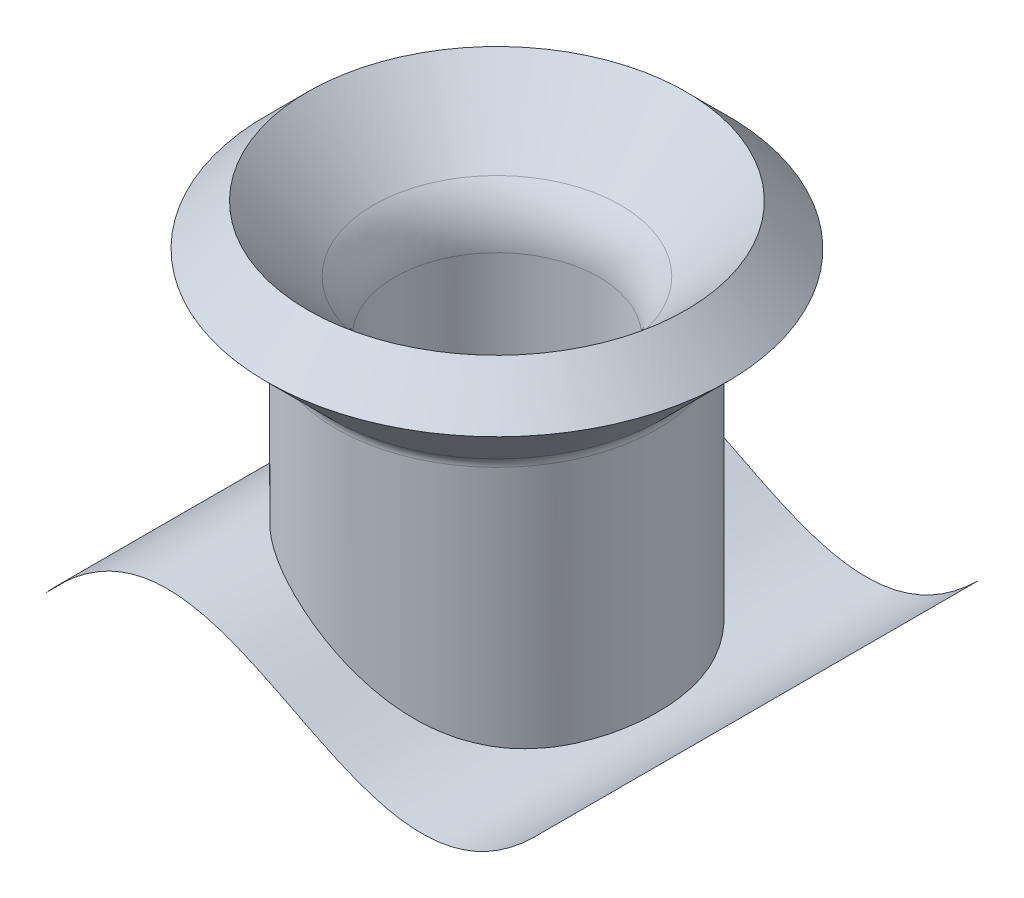
ISO-10303-21;
HEADER;
FILE_DESCRIPTION(('STEP AP214'),'2;1');
FILE_NAME('part.step','',(''),(''),'','','');
FILE_SCHEMA(('AUTOMOTIVE_DESIGN { 1 0 10303 214 1 1 1 1 }'));
ENDSEC;
DATA;
#1=APPLICATION_CONTEXT('core data for automotive mechanical design processes');
#2=APPLICATION_PROTOCOL_DEFINITION('international standard','automotive_design',2000,#1);
#3=PRODUCT_CONTEXT('',#1,'mechanical');
#4=PRODUCT('Part','Part','',(#3));
#5=PRODUCT_RELATED_PRODUCT_CATEGORY('part','',(#4));
#6=PRODUCT_DEFINITION_FORMATION('','',#4);
#7=PRODUCT_DEFINITION_CONTEXT('part definition',#1,'design');
#8=PRODUCT_DEFINITION('design','',#6,#7);
#9=PRODUCT_DEFINITION_SHAPE('','',#8);
#10=(LENGTH_UNIT() NAMED_UNIT(*) SI_UNIT(.MILLI.,.METRE.));
#11=(NAMED_UNIT(*) PLANE_ANGLE_UNIT() SI_UNIT($,.RADIAN.));
#12=(NAMED_UNIT(*) SI_UNIT($,.STERADIAN.) SOLID_ANGLE_UNIT());
#13=UNCERTAINTY_MEASURE_WITH_UNIT(LENGTH_MEASURE(1.E-05),#10,'distance_accuracy_value','');
#14=(GEOMETRIC_REPRESENTATION_CONTEXT(3) GLOBAL_UNCERTAINTY_ASSIGNED_CONTEXT((#13)) GLOBAL_UNIT_ASSIGNED_CONTEXT((#10,
#11,#12)) REPRESENTATION_CONTEXT('',''));
#15=CARTESIAN_POINT('',(0.,0.,0.));
#16=DIRECTION('',(0.,0.,1.));
#17=DIRECTION('',(1.,0.,0.));
#18=AXIS2_PLACEMENT_3D('',#15,#16,#17);
#19=CARTESIAN_POINT('',(44.9906658125201,27.2163737069206,0.));
#20=CARTESIAN_POINT('',(13.6993494881667,-3.55061906770293,0.));
#21=CARTESIAN_POINT('',(-8.62408056963471,56.2244401956315,0.));
#22=CARTESIAN_POINT('',(-39.7507653745492,21.6680669395259,0.));
#23=B_SPLINE_CURVE_WITH_KNOTS('',3,(#19,#20,#21,#22),.UNSPECIFIED.,.F.,.F.,(4,4),(0.,1.),.UNSPECIFIED.);
#24=DIRECTION('',(0.,0.,1.));
#25=VECTOR('',#24,1.);
#26=SURFACE_OF_LINEAR_EXTRUSION('',#23,#25);
#27=CARTESIAN_POINT('',(44.9906658125201,27.2163737069206,38.608));
#28=CARTESIAN_POINT('',(13.6993494881667,-3.55061906770293,38.608));
#29=CARTESIAN_POINT('',(-8.62408056963471,56.2244401956315,38.608));
#30=CARTESIAN_POINT('',(-39.7507653745492,21.6680669395259,38.608));
#31=B_SPLINE_CURVE_WITH_KNOTS('',3,(#27,#28,#29,#30),.UNSPECIFIED.,.F.,.F.,(4,4),(0.,1.),.UNSPECIFIED.);
#32=CARTESIAN_POINT('',(44.9906658125201,27.2163737069206,38.608));
#33=VERTEX_POINT('',#32);
#34=CARTESIAN_POINT('',(-39.7507653745492,21.6680669395259,38.608));
#35=VERTEX_POINT('',#34);
#36=EDGE_CURVE('E61',#33,#35,#31,.T.);
#37=ORIENTED_EDGE('',*,*,#36,.F.);
#38=DIRECTION('',(0.,0.,1.));
#39=VECTOR('',#38,1.);
#40=CARTESIAN_POINT('',(44.9906658125201,27.2163737069206,0.));
#41=LINE('',#40,#39);
#42=CARTESIAN_POINT('',(44.9906658125201,27.2163737069206,-38.608));
#43=VERTEX_POINT('',#42);
#44=EDGE_CURVE('E53',#43,#33,#41,.T.);
#45=ORIENTED_EDGE('',*,*,#44,.F.);
#46=CARTESIAN_POINT('',(44.9906658125201,27.2163737069206,-38.608));
#47=CARTESIAN_POINT('',(13.6993494881667,-3.55061906770293,-38.608));
#48=CARTESIAN_POINT('',(-8.62408056963471,56.2244401956315,-38.608));
#49=CARTESIAN_POINT('',(-39.7507653745492,21.6680669395259,-38.608));
#50=B_SPLINE_CURVE_WITH_KNOTS('',3,(#46,#47,#48,#49),.UNSPECIFIED.,.F.,.F.,(4,4),(0.,1.),.UNSPECIFIED.);
#51=CARTESIAN_POINT('',(-39.7507653745492,21.6680669395259,-38.608));
#52=VERTEX_POINT('',#51);
#53=EDGE_CURVE('E71',#43,#52,#50,.T.);
#54=ORIENTED_EDGE('',*,*,#53,.T.);
#55=DIRECTION('',(0.,0.,1.));
#56=VECTOR('',#55,1.);
#57=CARTESIAN_POINT('',(-39.7507653745492,21.6680669395259,0.));
#58=LINE('',#57,#56);
#59=EDGE_CURVE('E12',#52,#35,#58,.T.);
#60=ORIENTED_EDGE('',*,*,#59,.T.);
#61=EDGE_LOOP('',(#37,#45,#54,#60));
#62=FACE_BOUND('',#61,.T.);
#63=ADVANCED_FACE('F51',(#62),#26,.T.);
#64=OPEN_SHELL('',(#63));
#65=SHELL_BASED_SURFACE_MODEL('B2',(#64));
#66=CARTESIAN_POINT('',(0.,77.6126499684862,0.));
#67=DIRECTION('',(0.,-1.,0.));
#68=DIRECTION('',(0.,0.,-1.));
#69=AXIS2_PLACEMENT_3D('',#66,#67,#68);
#70=CONICAL_SURFACE('',#69,36.4535937540082,0.78539816339745);
#71=CARTESIAN_POINT('',(0.,81.2047524169139,0.));
#72=DIRECTION('',(0.,1.,0.));
#73=DIRECTION('',(0.,0.,1.));
#74=AXIS2_PLACEMENT_3D('',#71,#72,#73);
#75=CIRCLE('',#74,32.8614913055806);
#76=CARTESIAN_POINT('',(0.,81.2047524169139,32.8614913055806));
#77=VERTEX_POINT('',#76);
#78=EDGE_CURVE('E135',#77,#77,#75,.T.);
#79=ORIENTED_EDGE('',*,*,#78,.F.);
#80=EDGE_LOOP('',(#79));
#81=FACE_BOUND('',#80,.T.);
#82=CARTESIAN_POINT('',(0.,74.0205475200586,0.));
#83=DIRECTION('',(0.,1.,0.));
#84=DIRECTION('',(0.,0.,1.));
#85=AXIS2_PLACEMENT_3D('',#82,#83,#84);
#86=CIRCLE('',#85,40.0456962024359);
#87=CARTESIAN_POINT('',(0.,74.0205475200586,40.0456962024359));
#88=VERTEX_POINT('',#87);
#89=EDGE_CURVE('E155',#88,#88,#86,.T.);
#90=ORIENTED_EDGE('',*,*,#89,.T.);
#91=EDGE_LOOP('',(#90));
#92=FACE_BOUND('',#91,.T.);
#93=ADVANCED_FACE('F112',(#81,#92),#70,.T.);
#94=CARTESIAN_POINT('',(0.,67.6001024484277,0.));
#95=DIRECTION('',(0.,1.,0.));
#96=DIRECTION('',(0.,0.,1.));
#97=AXIS2_PLACEMENT_3D('',#94,#95,#96);
#98=CONICAL_SURFACE('',#97,19.2568413370944,0.785398163397447);
#99=ORIENTED_EDGE('',*,*,#78,.T.);
#100=EDGE_LOOP('',(#99));
#101=FACE_BOUND('',#100,.T.);
#102=CARTESIAN_POINT('',(0.,69.8319487757862,0.));
#103=DIRECTION('',(0.,1.,0.));
#104=DIRECTION('',(0.,0.,1.));
#105=AXIS2_PLACEMENT_3D('',#102,#103,#104);
#106=CIRCLE('',#105,21.4886876644529);
#107=CARTESIAN_POINT('',(0.,69.8319487757862,21.4886876644529));
#108=VERTEX_POINT('',#107);
#109=EDGE_CURVE('E124',#108,#108,#106,.F.);
#110=ORIENTED_EDGE('',*,*,#109,.T.);
#111=EDGE_LOOP('',(#110));
#112=FACE_BOUND('',#111,.T.);
#113=ADVANCED_FACE('F178',(#101,#112),#98,.F.);
#114=CARTESIAN_POINT('',(0.,0.,0.));
#115=DIRECTION('',(0.,1.,0.));
#116=DIRECTION('',(0.,0.,1.));
#117=AXIS2_PLACEMENT_3D('',#114,#115,#116);
#118=CYLINDRICAL_SURFACE('',#117,17.7689437855221);
#119=CARTESIAN_POINT('',(0.,27.1470273012276,17.7689437855221));
#120=CARTESIAN_POINT('',(-0.499090342003875,27.3939417430137,17.7689435917205));
#121=CARTESIAN_POINT('',(-0.999309391075133,27.638626225522,17.7479267182507));
#122=CARTESIAN_POINT('',(-2.00002180400163,28.1200111505653,17.663165687857));
#123=CARTESIAN_POINT('',(-2.50051517567803,28.3567113519861,17.5994202418004));
#124=CARTESIAN_POINT('',(-3.49936309335655,28.8185614147484,17.4283246724808));
#125=CARTESIAN_POINT('',(-3.99771787594533,29.0437125855792,17.3209795051453));
#126=CARTESIAN_POINT('',(-4.9894248925397,29.4790191753142,17.0617591564977));
#127=CARTESIAN_POINT('',(-5.48277724351661,29.6891749455511,16.9098850188974));
#128=CARTESIAN_POINT('',(-6.46467214596281,30.0928020610182,16.5595028043506));
#129=CARTESIAN_POINT('',(-6.95314829079475,30.2861322829141,16.3606442213196));
#130=CARTESIAN_POINT('',(-7.91695308229859,30.6514144178656,15.9166161669454));
#131=CARTESIAN_POINT('',(-8.3922816501376,30.8233662027577,15.6714464179893));
#132=CARTESIAN_POINT('',(-9.32423777104511,31.1436320830451,15.1354747676303));
#133=CARTESIAN_POINT('',(-9.78088263803122,31.2919684488535,14.844716378307));
#134=CARTESIAN_POINT('',(-10.6703962962787,31.5641192300025,14.2187769253392));
#135=CARTESIAN_POINT('',(-11.1032684158112,31.6879370843812,13.8836021026977));
#136=CARTESIAN_POINT('',(-11.8877742499998,31.8973832633706,13.2154388643007));
#137=CARTESIAN_POINT('',(-12.2428253610112,31.9858433591846,12.8873339866418));
#138=CARTESIAN_POINT('',(-12.9268694582797,32.1450063783864,12.2010680295498));
#139=CARTESIAN_POINT('',(-13.2558646503708,32.2157108060305,11.8429094996879));
#140=CARTESIAN_POINT('',(-13.8846319615344,32.3409182653735,11.0990803156534));
#141=CARTESIAN_POINT('',(-14.1843992544931,32.3954186244894,10.713405136074));
#142=CARTESIAN_POINT('',(-14.7518592413756,32.490248021486,9.91750364838051));
#143=CARTESIAN_POINT('',(-15.0195516351199,32.5305769267471,9.50727711055126));
#144=CARTESIAN_POINT('',(-15.510633214742,32.5980467131374,8.68199543176607));
#145=CARTESIAN_POINT('',(-15.7353524595146,32.6256446265383,8.26776746505745));
#146=CARTESIAN_POINT('',(-16.1513271471846,32.6720819092077,7.42239240258778));
#147=CARTESIAN_POINT('',(-16.3425839086833,32.6909216236447,6.9912459743249));
#148=CARTESIAN_POINT('',(-16.6902803685656,32.7219211055308,6.11491023766492));
#149=CARTESIAN_POINT('',(-16.8467199444532,32.7340808494781,5.66972087986741));
#150=CARTESIAN_POINT('',(-17.1237247066858,32.7535804984587,4.76820722954478));
#151=CARTESIAN_POINT('',(-17.2442885796602,32.7609202270483,4.31188253002844));
#152=CARTESIAN_POINT('',(-17.4530654050995,32.77255261272,3.37157213651489));
#153=CARTESIAN_POINT('',(-17.539695448227,32.7767033542498,2.8872325564));
#154=CARTESIAN_POINT('',(-17.6725045193989,32.7826854041292,1.91302019244124));
#155=CARTESIAN_POINT('',(-17.718682611703,32.7845166588246,1.42314728086504));
#156=CARTESIAN_POINT('',(-17.7702689179515,32.7865449696493,0.441195053679276));
#157=CARTESIAN_POINT('',(-17.7756721922942,32.7867418277824,-0.0508845220283573));
#158=CARTESIAN_POINT('',(-17.7456583429045,32.7855818146235,-1.03379516404093));
#159=CARTESIAN_POINT('',(-17.7102410624079,32.7842249373646,-1.52462622554392));
#160=CARTESIAN_POINT('',(-17.5980070092481,32.7793945043723,-2.50887394050801));
#161=CARTESIAN_POINT('',(-17.5205865842395,32.7758899860269,-3.00222173403414));
#162=CARTESIAN_POINT('',(-17.324516945729,32.7655769382713,-3.98062961753048));
#163=CARTESIAN_POINT('',(-17.205867071388,32.7587683559017,-4.46568957452982));
#164=CARTESIAN_POINT('',(-16.9281912712827,32.7401395573992,-5.42407857609114));
#165=CARTESIAN_POINT('',(-16.7691608398179,32.7283187819024,-5.89740630508682));
#166=CARTESIAN_POINT('',(-16.4119316994178,32.6975207826945,-6.82880880055531));
#167=CARTESIAN_POINT('',(-16.2137333733903,32.6785436289431,-7.28688371608949));
#168=CARTESIAN_POINT('',(-15.7808109483193,32.6311111459363,-8.18213670609837));
#169=CARTESIAN_POINT('',(-15.5462723342722,32.6027031549541,-8.619406922002));
#170=CARTESIAN_POINT('',(-15.0419222193675,32.5338683724652,-9.47213272947701));
#171=CARTESIAN_POINT('',(-14.7721108932884,32.4934416405108,-9.88758842912633));
#172=CARTESIAN_POINT('',(-14.1997774236324,32.3981674859502,-10.6932555875585));
#173=CARTESIAN_POINT('',(-13.897272450106,32.3433276113783,-11.0834801267862));
#174=CARTESIAN_POINT('',(-13.2623289442275,32.2171025375373,-11.8358895223934));
#175=CARTESIAN_POINT('',(-12.9298916944675,32.1457180469958,-12.1980755789807));
#176=CARTESIAN_POINT('',(-12.2515991738447,31.9878766944109,-12.8784934968802));
#177=CARTESIAN_POINT('',(-11.9067377029738,31.9020977143598,-13.1978742618831));
#178=CARTESIAN_POINT('',(-11.1956787466359,31.7129287114687,-13.8061959350822));
#179=CARTESIAN_POINT('',(-10.8294819026201,31.6095392179118,-14.095137757697));
#180=CARTESIAN_POINT('',(-10.079178460639,31.3849701059949,-14.6410654505657));
#181=CARTESIAN_POINT('',(-9.69507166611316,31.2637902923558,-14.8980509699879));
#182=CARTESIAN_POINT('',(-8.91237611235269,31.0041151767068,-15.3790747223108));
#183=CARTESIAN_POINT('',(-8.51378711642373,30.8656195916008,-15.6031124164162));
#184=CARTESIAN_POINT('',(-7.70843979669207,30.5734787485313,-16.0161984269403));
#185=CARTESIAN_POINT('',(-7.30176543098768,30.4199552290908,-16.205497159199));
#186=CARTESIAN_POINT('',(-6.48027655868879,30.0983933225831,-16.5511322707054));
#187=CARTESIAN_POINT('',(-6.06546213367745,29.9303550809312,-16.7074689801284));
#188=CARTESIAN_POINT('',(-5.23009367998919,29.5815265868473,-16.9875139090602));
#189=CARTESIAN_POINT('',(-4.80953793465541,29.4007324499258,-17.1112121345055));
#190=CARTESIAN_POINT('',(-3.96494597582762,29.0284581618894,-17.3264109704864));
#191=CARTESIAN_POINT('',(-3.54090953882806,28.8369773198981,-17.4179094965685));
#192=CARTESIAN_POINT('',(-2.6403714374252,28.422066269622,-17.5783171470399));
#193=CARTESIAN_POINT('',(-2.16365454801178,28.1975522303578,-17.6432211045271));
#194=CARTESIAN_POINT('',(-1.21019887231884,27.7408635696093,-17.7341525418538));
#195=CARTESIAN_POINT('',(-0.733460086518257,27.5086884732064,-17.7601776068977));
#196=CARTESIAN_POINT('',(0.218679254561904,27.0395369668074,-17.7739813651607));
#197=CARTESIAN_POINT('',(0.694078390011636,26.8025567718427,-17.7617286441571));
#198=CARTESIAN_POINT('',(1.64158537903891,26.3269880761888,-17.6993222112971));
#199=CARTESIAN_POINT('',(2.11369301266728,26.0883994700762,-17.6491659906419));
#200=CARTESIAN_POINT('',(3.12360546449224,25.576852893608,-17.5007590901493));
#201=CARTESIAN_POINT('',(3.66063701535625,25.3041104196182,-17.3964203974535));
#202=CARTESIAN_POINT('',(4.72578745707672,24.7648243691304,-17.137755972949));
#203=CARTESIAN_POINT('',(5.25390542284957,24.4982814349707,-16.9834250859281));
#204=CARTESIAN_POINT('',(6.29814215786652,23.9757283897426,-16.6244854369572));
#205=CARTESIAN_POINT('',(6.81426188846208,23.719717433532,-16.4198807184722));
#206=CARTESIAN_POINT('',(7.83082100372969,23.2223294164836,-15.9600976649245));
#207=CARTESIAN_POINT('',(8.33126161330936,22.9809512111,-15.7049232920061));
#208=CARTESIAN_POINT('',(9.30099719773877,22.5217960189887,-15.1503042287975));
#209=CARTESIAN_POINT('',(9.77073917112732,22.3036108366531,-14.851982030797));
#210=CARTESIAN_POINT('',(10.686083677754,21.8878263889941,-14.2076093625537));
#211=CARTESIAN_POINT('',(11.1316861316114,21.6902271913642,-13.8615587353732));
#212=CARTESIAN_POINT('',(11.9927856983876,21.3181310086966,-13.1236271270464));
#213=CARTESIAN_POINT('',(12.4083146532529,21.1436094220682,-12.7317958032956));
#214=CARTESIAN_POINT('',(13.2039858844011,20.8188387047326,-11.9045901786363));
#215=CARTESIAN_POINT('',(13.5841343261665,20.6685853416252,-11.469223491825));
#216=CARTESIAN_POINT('',(14.2515318150462,20.4126091426929,-10.6243069923496));
#217=CARTESIAN_POINT('',(14.5442741036416,20.3035894514073,-10.2200763839306));
#218=CARTESIAN_POINT('',(15.0964040322672,20.1032741129679,-9.38532217544286));
#219=CARTESIAN_POINT('',(15.3557950790289,20.0119766550537,-8.95480126748775));
#220=CARTESIAN_POINT('',(15.8382732828305,19.8463882199246,-8.07081331891491));
#221=CARTESIAN_POINT('',(16.0613632637555,19.7720959196838,-7.61734806675464));
#222=CARTESIAN_POINT('',(16.4687828632163,19.6395099210726,-6.69107763179415));
#223=CARTESIAN_POINT('',(16.6531131384484,19.5812159516413,-6.21827277682226));
#224=CARTESIAN_POINT('',(16.9705077303836,19.4827875038763,-5.28801351569566));
#225=CARTESIAN_POINT('',(17.1061001021328,19.4417287974144,-4.831516640805));
#226=CARTESIAN_POINT('',(17.3403502795172,19.371807003282,-3.90824932396453));
#227=CARTESIAN_POINT('',(17.4390101104077,19.3429432468706,-3.44147944683797));
#228=CARTESIAN_POINT('',(17.5985189041397,19.2967100878695,-2.50099592681429));
#229=CARTESIAN_POINT('',(17.6593701491661,19.2793399915005,-2.02728270479539));
#230=CARTESIAN_POINT('',(17.7427450427194,19.2556250956491,-1.07621418625177));
#231=CARTESIAN_POINT('',(17.7652680141374,19.2492804909435,-0.598858825534515));
#232=CARTESIAN_POINT('',(17.7718035978396,19.2474346365396,0.358031427550991));
#233=CARTESIAN_POINT('',(17.7556631167125,19.2519764933703,0.837567455251621));
#234=CARTESIAN_POINT('',(17.6846918107568,19.2721228767528,1.79353414430342));
#235=CARTESIAN_POINT('',(17.6298610326051,19.2877273899583,2.26996480940028));
#236=CARTESIAN_POINT('',(17.4819884390863,19.3304254836671,3.21633446147235));
#237=CARTESIAN_POINT('',(17.3889470412358,19.3575189386341,3.68627351932152));
#238=CARTESIAN_POINT('',(17.1654833551363,19.4238707581835,4.61630397170402));
#239=CARTESIAN_POINT('',(17.0350611552853,19.4631290939985,5.07639538952223));
#240=CARTESIAN_POINT('',(16.7379203842325,19.5546923464073,5.98376604996037));
#241=CARTESIAN_POINT('',(16.5711741882107,19.6070071970676,6.43103524656257));
#242=CARTESIAN_POINT('',(16.2030291896816,19.7255832781857,7.30916293092981));
#243=CARTESIAN_POINT('',(16.0016305193795,19.7918444554358,7.74002148129669));
#244=CARTESIAN_POINT('',(15.5662023638221,19.9391562635798,8.582153008728));
#245=CARTESIAN_POINT('',(15.332180384669,20.0202034937595,8.99343046197093));
#246=CARTESIAN_POINT('',(14.8338090137298,20.1977764585924,9.79365384156351));
#247=CARTESIAN_POINT('',(14.5694598475611,20.294302078097,10.1825999340139));
#248=CARTESIAN_POINT('',(14.0148874562763,20.5025420943991,10.9331892119925));
#249=CARTESIAN_POINT('',(13.7248427626027,20.6141541452739,11.2949928115992));
#250=CARTESIAN_POINT('',(13.1202603334347,20.8530510799648,11.991954020825));
#251=CARTESIAN_POINT('',(12.8057228016433,20.9803358334386,12.3271118520059));
#252=CARTESIAN_POINT('',(12.1550476245953,21.2502034652556,12.9691604573231));
#253=CARTESIAN_POINT('',(11.818907373524,21.3927881905429,13.2760478104449));
#254=CARTESIAN_POINT('',(11.1279785989801,21.6924498542653,13.8603092991633));
#255=CARTESIAN_POINT('',(10.7731895218835,21.8495272230452,14.1376825578407));
#256=CARTESIAN_POINT('',(10.0338167919443,22.1833110306947,14.6722157040438));
#257=CARTESIAN_POINT('',(9.64861211968913,22.360539800981,14.928189323074));
#258=CARTESIAN_POINT('',(8.86398907885506,22.7277361364157,15.4070220636923));
#259=CARTESIAN_POINT('',(8.4645703032851,22.917704066461,15.6298802361418));
#260=CARTESIAN_POINT('',(7.65394579932342,23.3085331038332,16.0424245693823));
#261=CARTESIAN_POINT('',(7.24273632411365,23.5093976923709,16.2321000463887));
#262=CARTESIAN_POINT('',(6.41085325137834,23.9198744035312,16.578278566456));
#263=CARTESIAN_POINT('',(5.99017937236546,24.1294867864868,16.7347806214368));
#264=CARTESIAN_POINT('',(5.11441203524188,24.5687035541476,17.0236302052973));
#265=CARTESIAN_POINT('',(4.65882316879901,24.7987343171765,17.1538269129773));
#266=CARTESIAN_POINT('',(3.7409713260261,25.2634312915222,17.377099884011));
#267=CARTESIAN_POINT('',(3.27870811181192,25.4980976681699,17.470174820886));
#268=CARTESIAN_POINT('',(2.34896589118976,25.9693391095026,17.6192928064028));
#269=CARTESIAN_POINT('',(1.88148479415429,26.2059149278948,17.6753204271015));
#270=CARTESIAN_POINT('',(0.943005703450676,26.6780011204448,17.7501464920738));
#271=CARTESIAN_POINT('',(0.472007618702047,26.9135114667543,17.7689439688072));
#272=CARTESIAN_POINT('',(0.,27.1470273012276,17.7689437855221));
#273=B_SPLINE_CURVE_WITH_KNOTS('',3,(#119,#120,#121,#122,#123,#124,#125,#126,#127,#128,#129,
#130,#131,#132,#133,#134,#135,#136,#137,#138,#139,#140,#141,#142,#143,#144,#145,#146,#147,#148,
#149,#150,#151,#152,#153,#154,#155,#156,#157,#158,#159,#160,#161,#162,#163,#164,#165,#166,#167,
#168,#169,#170,#171,#172,#173,#174,#175,#176,#177,#178,#179,#180,#181,#182,#183,#184,#185,#186,
#187,#188,#189,#190,#191,#192,#193,#194,#195,#196,#197,#198,#199,#200,#201,#202,#203,#204,#205,
#206,#207,#208,#209,#210,#211,#212,#213,#214,#215,#216,#217,#218,#219,#220,#221,#222,#223,#224,
#225,#226,#227,#228,#229,#230,#231,#232,#233,#234,#235,#236,#237,#238,#239,#240,#241,#242,#243,
#244,#245,#246,#247,#248,#249,#250,#251,#252,#253,#254,#255,#256,#257,#258,#259,#260,#261,#262,
#263,#264,#265,#266,#267,#268,#269,#270,#271,#272),.UNSPECIFIED.,.T.,.F.,(4,2,2,2,2,2,2,2,2,2,2,
2,2,2,2,2,2,2,2,2,2,2,2,2,2,2,2,2,2,2,2,2,2,2,2,2,2,2,2,2,2,2,2,2,2,2,2,2,2,2,2,2,2,2,2,2,2,2,2,
2,2,2,2,2,2,2,2,2,2,2,2,2,2,2,2,2,4),(0.,1.67010143248297,3.34025325464368,5.01021528577267,
6.68013817788598,8.36293566400451,10.0457432379935,11.7269543252831,13.4079294336992,
14.8804427678061,16.3528313087782,17.825462560431,19.298107592937,20.7127261300082,
22.1272889109605,23.5418566686367,24.9564762057327,26.4308923117631,27.9053425232958,
29.3799713519262,30.8546058436248,32.3510173331515,33.847452808753,35.3440553314588,
36.8406432240007,38.3298297700039,39.8190089372789,41.3074097832947,42.7957468819552,
44.2273781776925,45.6589664534079,47.0905704444072,48.522197843803,49.9430609834253,
51.3639098898152,52.7851933635106,54.2065688273303,55.7977702535346,57.3890705062774,
58.9816770672981,60.5743890507575,62.4061215322564,64.2380429627996,66.0698171022629,
67.9014477784882,69.6919578483234,71.4824738057436,73.2710653483257,75.0593446213163,
76.5899488353094,78.120396578154,79.6507252094374,81.1810279106469,82.6132777855324,
84.0454491091802,85.4775339763446,86.9096441425173,88.3474343189247,89.7852227607522,
91.2229954926943,92.660764824627,94.099631438094,95.5384925621541,96.9770231719992,
98.4155430806654,99.8447528002566,101.273950634605,102.703321189814,104.132734202447,
105.617073561975,107.101455456696,108.586314399646,110.071217563341,111.649937823144,
113.228714490576,114.808148208629,116.387622972601),.UNSPECIFIED.);
#274=CARTESIAN_POINT('',(0.,27.1470273012276,17.7689437855221));
#275=VERTEX_POINT('',#274);
#276=EDGE_CURVE('E138',#275,#275,#273,.T.);
#277=ORIENTED_EDGE('',*,*,#276,.T.);
#278=EDGE_LOOP('',(#277));
#279=FACE_BOUND('',#278,.T.);
#280=CARTESIAN_POINT('',(0.,60.851692654717,0.));
#281=DIRECTION('',(0.,1.,0.));
#282=DIRECTION('',(0.,0.,1.));
#283=AXIS2_PLACEMENT_3D('',#280,#281,#282);
#284=CIRCLE('',#283,17.7689437855221);
#285=CARTESIAN_POINT('',(0.,60.851692654717,17.7689437855221));
#286=VERTEX_POINT('',#285);
#287=EDGE_CURVE('E129',#286,#286,#284,.T.);
#288=ORIENTED_EDGE('',*,*,#287,.T.);
#289=EDGE_LOOP('',(#288));
#290=FACE_BOUND('',#289,.T.);
#291=ADVANCED_FACE('F164',(#279,#290),#118,.F.);
#292=CARTESIAN_POINT('',(0.,60.851692654717,0.));
#293=DIRECTION('',(0.,-1.,0.));
#294=DIRECTION('',(0.,0.,-1.));
#295=AXIS2_PLACEMENT_3D('',#292,#293,#294);
#296=TOROIDAL_SURFACE('',#295,30.4689437855221,12.7);
#297=ORIENTED_EDGE('',*,*,#287,.F.);
#298=EDGE_LOOP('',(#297));
#299=FACE_BOUND('',#298,.T.);
#300=ORIENTED_EDGE('',*,*,#109,.F.);
#301=EDGE_LOOP('',(#300));
#302=FACE_BOUND('',#301,.T.);
#303=ADVANCED_FACE('F188',(#299,#302),#296,.T.);
#304=CARTESIAN_POINT('',(0.,60.4158975515724,0.));
#305=DIRECTION('',(0.,1.,0.));
#306=DIRECTION('',(0.,0.,1.));
#307=AXIS2_PLACEMENT_3D('',#304,#305,#306);
#308=CONICAL_SURFACE('',#307,26.4410462339497,0.785398163397447);
#309=ORIENTED_EDGE('',*,*,#89,.F.);
#310=EDGE_LOOP('',(#309));
#311=FACE_BOUND('',#310,.T.);
#312=CARTESIAN_POINT('',(0.,62.6477438789309,0.));
#313=DIRECTION('',(0.,1.,0.));
#314=DIRECTION('',(0.,0.,1.));
#315=AXIS2_PLACEMENT_3D('',#312,#313,#314);
#316=CIRCLE('',#315,28.6728925613082);
#317=CARTESIAN_POINT('',(0.,62.6477438789309,28.6728925613082));
#318=VERTEX_POINT('',#317);
#319=EDGE_CURVE('E148',#318,#318,#316,.F.);
#320=ORIENTED_EDGE('',*,*,#319,.F.);
#321=EDGE_LOOP('',(#320));
#322=FACE_BOUND('',#321,.T.);
#323=ADVANCED_FACE('F193',(#311,#322),#308,.T.);
#324=CARTESIAN_POINT('',(0.,0.,0.));
#325=DIRECTION('',(0.,1.,0.));
#326=DIRECTION('',(0.,0.,1.));
#327=AXIS2_PLACEMENT_3D('',#324,#325,#326);
#328=CYLINDRICAL_SURFACE('',#327,27.9289437855221);
#329=CARTESIAN_POINT('',(0.,27.1470273012276,27.9289437855221));
#330=CARTESIAN_POINT('',(-0.688039048096472,27.4874195697827,27.9289400399535));
#331=CARTESIAN_POINT('',(-1.37815479334917,27.8235509778821,27.9035491977771));
#332=CARTESIAN_POINT('',(-2.76200663960232,28.4802289930589,27.800693613823));
#333=CARTESIAN_POINT('',(-3.45574260491367,28.8007761796667,27.7232308100359));
#334=CARTESIAN_POINT('',(-4.8440116352186,29.4182128404196,27.5145975850323));
#335=CARTESIAN_POINT('',(-5.53854003275526,29.7151501849288,27.3835393297236));
#336=CARTESIAN_POINT('',(-6.92725611704163,30.278501899448,27.0655885822255));
#337=CARTESIAN_POINT('',(-7.62144384325149,30.5449219797613,26.8787065593092));
#338=CARTESIAN_POINT('',(-8.89556545267038,31.0006335671115,26.4814399936564));
#339=CARTESIAN_POINT('',(-9.47615081783412,31.195455614788,26.2794897158227));
#340=CARTESIAN_POINT('',(-10.6308321894516,31.5544394008276,25.8339714845226));
#341=CARTESIAN_POINT('',(-11.2049288764599,31.7186043831755,25.5904079396029));
#342=CARTESIAN_POINT('',(-12.3421201027127,32.0131549508699,25.0617399768169));
#343=CARTESIAN_POINT('',(-12.9052219311287,32.1435636706084,24.7766642192579));
#344=CARTESIAN_POINT('',(-14.0161336863292,32.3690104197752,24.1655896686162));
#345=CARTESIAN_POINT('',(-14.5639435583027,32.464048322439,23.8395907288755));
#346=CARTESIAN_POINT('',(-15.6400352182943,32.6186969307248,23.1478892046112));
#347=CARTESIAN_POINT('',(-16.1682932903172,32.678265853899,22.7821403918691));
#348=CARTESIAN_POINT('',(-17.200007118374,32.7633637014795,22.013619806355));
#349=CARTESIAN_POINT('',(-17.7034624135588,32.788891993622,21.6108473460618));
#350=CARTESIAN_POINT('',(-18.6819956994105,32.8090335769397,20.7707765279719));
#351=CARTESIAN_POINT('',(-19.1570497565475,32.8036211555391,20.333449752283));
#352=CARTESIAN_POINT('',(-20.0751734932193,32.7661637527265,19.4275394555437));
#353=CARTESIAN_POINT('',(-20.5182419363722,32.73411774241,18.9589547275841));
#354=CARTESIAN_POINT('',(-21.3719745903688,32.6483332274719,17.9911924066418));
#355=CARTESIAN_POINT('',(-21.7824775268117,32.5944939516615,17.4918819607406));
#356=CARTESIAN_POINT('',(-22.567069761429,32.4707307103043,16.4672296181255));
#357=CARTESIAN_POINT('',(-22.9411552379379,32.4008050592296,15.9418849980841));
#358=CARTESIAN_POINT('',(-23.4739641000729,32.2881415124782,15.1361404272576));
#359=CARTESIAN_POINT('',(-23.6469110647092,32.2492739404144,14.8644913846598));
#360=CARTESIAN_POINT('',(-23.9831583841845,32.1696622695703,14.3156403525649));
#361=CARTESIAN_POINT('',(-24.1464609311264,32.1289186009884,14.0384396442498));
#362=CARTESIAN_POINT('',(-24.6218013054111,32.0048941829287,13.1987340219149));
#363=CARTESIAN_POINT('',(-24.9192503601828,31.9198247306394,12.6281581471737));
#364=CARTESIAN_POINT('',(-25.5261978601869,31.7343956824503,11.3588168703628));
#365=CARTESIAN_POINT('',(-25.8274725100495,31.6341642278283,10.6560975581724));
#366=CARTESIAN_POINT('',(-26.3718058262496,31.4428623682796,9.22703461520109));
#367=CARTESIAN_POINT('',(-26.6148590475035,31.3517928206699,8.50068878199005));
#368=CARTESIAN_POINT('',(-26.9342852405051,31.2275144621881,7.39708751456366));
#369=CARTESIAN_POINT('',(-27.0332257242691,31.1881467167249,7.02691930749009));
#370=CARTESIAN_POINT('',(-27.215886510873,31.1142660020764,6.28237915671024));
#371=CARTESIAN_POINT('',(-27.2996083513351,31.0797525425161,5.90800764174956));
#372=CARTESIAN_POINT('',(-27.4516356109432,31.016265004801,5.15566663421324));
#373=CARTESIAN_POINT('',(-27.519940422318,30.9872911450355,4.77769700040423));
#374=CARTESIAN_POINT('',(-27.6409491281521,30.9354564401904,4.01888573946437));
#375=CARTESIAN_POINT('',(-27.6936541438537,30.9125951557781,3.63804432076307));
#376=CARTESIAN_POINT('',(-27.7983726742929,30.8668710197277,2.74593519161322));
#377=CARTESIAN_POINT('',(-27.8442164473957,30.8465831489291,2.2337952990897));
#378=CARTESIAN_POINT('',(-27.9075698628631,30.8184591643682,1.20741482490416));
#379=CARTESIAN_POINT('',(-27.9250782410732,30.8106236061535,0.693174150543927));
#380=CARTESIAN_POINT('',(-27.9316642832912,30.8076820028718,-0.335517237534373));
#381=CARTESIAN_POINT('',(-27.9207427129298,30.8125756150029,-0.849967945223105));
#382=CARTESIAN_POINT('',(-27.870531393375,30.8349170202162,-1.87718028942935));
#383=CARTESIAN_POINT('',(-27.8312428900623,30.8523642619407,-2.3899419991344));
#384=CARTESIAN_POINT('',(-27.7245057914973,30.8991945705089,-3.41198805310661));
#385=CARTESIAN_POINT('',(-27.6570565973191,30.9285778912107,-3.9212723231809));
#386=CARTESIAN_POINT('',(-27.4943512346933,30.9982300205309,-4.93456293050081));
#387=CARTESIAN_POINT('',(-27.3990966018477,31.0384982280042,-5.43856955762125));
#388=CARTESIAN_POINT('',(-27.1369485835497,31.1468083605488,-6.64309199200964));
#389=CARTESIAN_POINT('',(-26.9566710638421,31.2194889315669,-7.34031930015836));
#390=CARTESIAN_POINT('',(-26.5434107246577,31.3785878285625,-8.71722884727623));
#391=CARTESIAN_POINT('',(-26.310430380794,31.4650055092092,-9.39691190868222));
#392=CARTESIAN_POINT('',(-25.7929275684964,31.6456148023788,-10.7362372490779));
#393=CARTESIAN_POINT('',(-25.5083438300105,31.7398155828154,-11.3958546045149));
#394=CARTESIAN_POINT('',(-24.8892640269605,31.9290203130164,-12.6911694167865));
#395=CARTESIAN_POINT('',(-24.5547637060318,32.0240243306202,-13.3268648280138));
#396=CARTESIAN_POINT('',(-23.805002001446,32.2156120498669,-14.6273987892944));
#397=CARTESIAN_POINT('',(-23.3851806427692,32.3115676859464,-15.2897072173628));
#398=CARTESIAN_POINT('',(-22.4899136588547,32.4853441131501,-16.5784481523931));
#399=CARTESIAN_POINT('',(-22.0144643997207,32.5631637185422,-17.2048783116188));
#400=CARTESIAN_POINT('',(-21.2622811006324,32.6584868637013,-18.1134136010472));
#401=CARTESIAN_POINT('',(-21.0052384057709,32.6866817082154,-18.4108833792598));
#402=CARTESIAN_POINT('',(-20.4784816116805,32.7347474891764,-18.9950596971051));
#403=CARTESIAN_POINT('',(-20.2087691910064,32.754619524835,-19.281767653519));
#404=CARTESIAN_POINT('',(-19.6572028052776,32.7848660555856,-19.8437723515844));
#405=CARTESIAN_POINT('',(-19.3753491315782,32.7952407784532,-20.119069366755));
#406=CARTESIAN_POINT('',(-18.8001761685015,32.8054206390415,-20.6575522682241));
#407=CARTESIAN_POINT('',(-18.5068581864923,32.8052269784667,-20.9207395280868));
#408=CARTESIAN_POINT('',(-17.8383484871449,32.7919063979631,-21.4955111235798));
#409=CARTESIAN_POINT('',(-17.4602864701815,32.7757121217568,-21.8037047251845));
#410=CARTESIAN_POINT('',(-16.6893629447969,32.7242392395891,-22.3992934620013));
#411=CARTESIAN_POINT('',(-16.2965013275484,32.6889604932664,-22.6866884442274));
#412=CARTESIAN_POINT('',(-15.4979012565734,32.5983825139649,-23.2395520749213));
#413=CARTESIAN_POINT('',(-15.0921637820206,32.5430848000609,-23.5050223851954));
#414=CARTESIAN_POINT('',(-14.2700138327696,32.4120999208328,-24.0130387036606));
#415=CARTESIAN_POINT('',(-13.8536057997395,32.3364211183786,-24.255594059411));
#416=CARTESIAN_POINT('',(-13.0120283763679,32.1648179228412,-24.7172688774876));
#417=CARTESIAN_POINT('',(-12.5868583826558,32.0688921312676,-24.9363867193729));
#418=CARTESIAN_POINT('',(-11.7299169060562,31.8575091113348,-25.3507691304665));
#419=CARTESIAN_POINT('',(-11.2981463064422,31.7420544758136,-25.5460368603269));
#420=CARTESIAN_POINT('',(-10.3058840533439,31.4571271099016,-25.9650057904991));
#421=CARTESIAN_POINT('',(-9.74381550452231,31.2816408535243,-26.1809230673776));
#422=CARTESIAN_POINT('',(-8.61539586444131,30.9034905406875,-26.5736308760397));
#423=CARTESIAN_POINT('',(-8.04904540086335,30.7008303974285,-26.7504270317988));
#424=CARTESIAN_POINT('',(-6.9140595852112,30.2719142687062,-27.0660118458073));
#425=CARTESIAN_POINT('',(-6.34542251393007,30.0456348765939,-27.2047622974858));
#426=CARTESIAN_POINT('',(-5.20833221384256,29.5737343607978,-27.4451631884623));
#427=CARTESIAN_POINT('',(-4.63987903204476,29.3281099902958,-27.546807383727));
#428=CARTESIAN_POINT('',(-3.21691580207211,28.6933965646868,-27.756528677204));
#429=CARTESIAN_POINT('',(-2.36329799326968,28.2946366934137,-27.8418054071144));
#430=CARTESIAN_POINT('',(-0.661651309822691,27.4763223444563,-27.9341148994177));
#431=CARTESIAN_POINT('',(0.186374755676674,27.0567582012622,-27.9411109445185));
#432=CARTESIAN_POINT('',(1.87692441368126,26.2093991794542,-27.8786561787239));
#433=CARTESIAN_POINT('',(2.71943858013519,25.7815935460693,-27.8090977420978));
#434=CARTESIAN_POINT('',(4.39696912425829,24.9309467283379,-27.5936128897981));
#435=CARTESIAN_POINT('',(5.23198743921595,24.508104252045,-27.4477068199127));
#436=CARTESIAN_POINT('',(6.77254440540784,23.7397413437535,-27.1051135107255));
#437=CARTESIAN_POINT('',(7.47926246668305,23.3919151212291,-26.9188892757007));
#438=CARTESIAN_POINT('',(8.88453349074097,22.7162236042075,-26.4883179698111));
#439=CARTESIAN_POINT('',(9.58308703865126,22.3883568720941,-26.243975091276));
#440=CARTESIAN_POINT('',(10.9676759166801,21.7604425192293,-25.6960841116412));
#441=CARTESIAN_POINT('',(11.6537346322201,21.4603374331938,-25.3926625379315));
#442=CARTESIAN_POINT('',(12.6708770033605,21.0354829744437,-24.892120845107));
#443=CARTESIAN_POINT('',(13.0079780565703,20.8980652325974,-24.7176788681726));
#444=CARTESIAN_POINT('',(13.6775102059934,20.6323488214784,-24.3535787078484));
#445=CARTESIAN_POINT('',(14.0099416787102,20.5040494135783,-24.1639217595973));
#446=CARTESIAN_POINT('',(14.7837907938983,20.2143575189278,-23.7009120725399));
#447=CARTESIAN_POINT('',(15.2230027323133,20.0569283739493,-23.421351787484));
#448=CARTESIAN_POINT('',(16.0893867047741,19.7609198765591,-22.8348680285825));
#449=CARTESIAN_POINT('',(16.5165580423383,19.622341612799,-22.5279429760954));
#450=CARTESIAN_POINT('',(17.3565005862255,19.3647126789858,-21.8873641046825));
#451=CARTESIAN_POINT('',(17.7692723647761,19.2456612322541,-21.5537113496366));
#452=CARTESIAN_POINT('',(18.5780468503143,19.027184207241,-20.8606257284788));
#453=CARTESIAN_POINT('',(18.9740491055212,18.9277591574423,-20.5011921685188));
#454=CARTESIAN_POINT('',(19.7469593223212,18.7480492710673,-19.7578081945756));
#455=CARTESIAN_POINT('',(20.1238664833553,18.6677652364532,-19.3738567542064));
#456=CARTESIAN_POINT('',(20.8563161784143,18.5253004002619,-18.5830692660423));
#457=CARTESIAN_POINT('',(21.2118621058635,18.463116717214,-18.1762368730796));
#458=CARTESIAN_POINT('',(21.9945902655803,18.3404273506044,-17.2261390697844));
#459=CARTESIAN_POINT('',(22.4144986370616,18.285110548096,-16.6761817370475));
#460=CARTESIAN_POINT('',(23.2129719876064,18.1973200985736,-15.5455117047856));
#461=CARTESIAN_POINT('',(23.5915421871956,18.1648435642771,-14.9648029025968));
#462=CARTESIAN_POINT('',(24.30484851313,18.1179587116054,-13.776097602437));
#463=CARTESIAN_POINT('',(24.6395681634639,18.1035571672256,-13.1680909623736));
#464=CARTESIAN_POINT('',(25.2628826246702,18.0878911317838,-11.9287018457172));
#465=CARTESIAN_POINT('',(25.5514737813102,18.0866276809953,-11.297317522053));
#466=CARTESIAN_POINT('',(26.0986779535039,18.0926186385562,-9.97161778840456));
#467=CARTESIAN_POINT('',(26.3539603560171,18.1004527748683,-9.27592875642803));
#468=CARTESIAN_POINT('',(26.8084304444808,18.1202967893828,-7.86652755172452));
#469=CARTESIAN_POINT('',(27.0076168764372,18.1323067609202,-7.15281497647982));
#470=CARTESIAN_POINT('',(27.3486380935116,18.1560721337357,-5.71191003262143));
#471=CARTESIAN_POINT('',(27.4904807658217,18.1678275698125,-4.98471953219182));
#472=CARTESIAN_POINT('',(27.7159591758197,18.1877793380877,-3.52131320174128));
#473=CARTESIAN_POINT('',(27.7995937152648,18.1959755970174,-2.78509718624318));
#474=CARTESIAN_POINT('',(27.9113278912567,18.2071066018603,-1.26443858936251));
#475=CARTESIAN_POINT('',(27.9358370328738,18.2097002155976,-0.479726966681496));
#476=CARTESIAN_POINT('',(27.9187277166838,18.2079400261183,1.0889892593576));
#477=CARTESIAN_POINT('',(27.877106325893,18.2035859147602,1.87299382981385));
#478=CARTESIAN_POINT('',(27.7280042519865,18.1890682600046,3.43504551298636));
#479=CARTESIAN_POINT('',(27.6204913974137,18.1789018789339,4.2130895274636));
#480=CARTESIAN_POINT('',(27.3403548752556,18.1556424659755,5.75731572465331));
#481=CARTESIAN_POINT('',(27.1677312662702,18.1425494367217,6.52349791804082));
#482=CARTESIAN_POINT('',(26.7588728576634,18.1179091779617,8.03757940192928));
#483=CARTESIAN_POINT('',(26.5227269172634,18.1063598225912,8.78550265207303));
#484=CARTESIAN_POINT('',(25.988343931067,18.0905175109364,10.2589464672825));
#485=CARTESIAN_POINT('',(25.6901061046133,18.0862246458913,10.9844667505526));
#486=CARTESIAN_POINT('',(25.0337832522388,18.0915554553333,12.4076398760519));
#487=CARTESIAN_POINT('',(24.6757145219699,18.101175345964,13.1053002423273));
#488=CARTESIAN_POINT('',(23.9024070126104,18.1414629437602,14.4676885709566));
#489=CARTESIAN_POINT('',(23.4871704506886,18.172129834833,15.1324178091363));
#490=CARTESIAN_POINT('',(22.7557102434135,18.2460482780349,16.2008222105839));
#491=CARTESIAN_POINT('',(22.4546641684974,18.2813235732937,16.6155327526021));
#492=CARTESIAN_POINT('',(21.8309266662172,18.3656586606953,17.4269414277685));
#493=CARTESIAN_POINT('',(21.5082352406653,18.4147184516839,17.8236395624247));
#494=CARTESIAN_POINT('',(20.8427434343646,18.5281386354453,18.5974835554248));
#495=CARTESIAN_POINT('',(20.4999436303251,18.5924985895699,18.9746299739291));
#496=CARTESIAN_POINT('',(19.7963330538145,18.7376088544915,19.7075841514113));
#497=CARTESIAN_POINT('',(19.4355431073767,18.8183405303891,20.063415580663));
#498=CARTESIAN_POINT('',(18.6974503439826,18.9970006546161,20.7529832604345));
#499=CARTESIAN_POINT('',(18.3201470098538,19.0949296418271,21.086718818124));
#500=CARTESIAN_POINT('',(17.5510891952777,19.3082515184452,21.7310113530823));
#501=CARTESIAN_POINT('',(17.1593364727708,19.4236422886835,22.0415711361523));
#502=CARTESIAN_POINT('',(16.2225469723906,19.7156375708081,22.7444120294837));
#503=CARTESIAN_POINT('',(15.6722753566783,19.8994621812734,23.1267769749549));
#504=CARTESIAN_POINT('',(14.5537041164435,20.2971656047093,23.8465534239332));
#505=CARTESIAN_POINT('',(13.9854059941808,20.5110419183547,24.1839686612539));
#506=CARTESIAN_POINT('',(12.8342755590511,20.9662119483895,24.8140750333148));
#507=CARTESIAN_POINT('',(12.2514274107226,21.207536652926,25.1067147267378));
#508=CARTESIAN_POINT('',(11.0752826999696,21.7136146101835,25.6472821538913));
#509=CARTESIAN_POINT('',(10.4819846544548,21.978371210264,25.8952034839689));
#510=CARTESIAN_POINT('',(9.08141516465335,22.6217101836881,26.4252095779795));
#511=CARTESIAN_POINT('',(8.27096020880382,23.0080427423269,26.6895578718745));
#512=CARTESIAN_POINT('',(6.64002714715299,23.8040591519572,27.1413445948111));
#513=CARTESIAN_POINT('',(5.81954529305991,24.2137519592564,27.3287532963517));
#514=CARTESIAN_POINT('',(4.16976297332164,25.0452746426278,27.6286604491233));
#515=CARTESIAN_POINT('',(3.34045227016794,25.4671198699172,27.7410593912068));
#516=CARTESIAN_POINT('',(1.67512279376572,26.3104315541372,27.891193939924));
#517=CARTESIAN_POINT('',(0.839105763509567,26.7318980797264,27.9289483534724));
#518=CARTESIAN_POINT('',(0.,27.1470273012276,27.9289437855221));
#519=B_SPLINE_CURVE_WITH_KNOTS('',3,(#329,#330,#331,#332,#333,#334,#335,#336,#337,#338,#339,
#340,#341,#342,#343,#344,#345,#346,#347,#348,#349,#350,#351,#352,#353,#354,#355,#356,#357,#358,
#359,#360,#361,#362,#363,#364,#365,#366,#367,#368,#369,#370,#371,#372,#373,#374,#375,#376,#377,
#378,#379,#380,#381,#382,#383,#384,#385,#386,#387,#388,#389,#390,#391,#392,#393,#394,#395,#396,
#397,#398,#399,#400,#401,#402,#403,#404,#405,#406,#407,#408,#409,#410,#411,#412,#413,#414,#415,
#416,#417,#418,#419,#420,#421,#422,#423,#424,#425,#426,#427,#428,#429,#430,#431,#432,#433,#434,
#435,#436,#437,#438,#439,#440,#441,#442,#443,#444,#445,#446,#447,#448,#449,#450,#451,#452,#453,
#454,#455,#456,#457,#458,#459,#460,#461,#462,#463,#464,#465,#466,#467,#468,#469,#470,#471,#472,
#473,#474,#475,#476,#477,#478,#479,#480,#481,#482,#483,#484,#485,#486,#487,#488,#489,#490,#491,
#492,#493,#494,#495,#496,#497,#498,#499,#500,#501,#502,#503,#504,#505,#506,#507,#508,#509,#510,
#511,#512,#513,#514,#515,#516,#517,#518),.UNSPECIFIED.,.T.,.F.,(4,2,2,2,2,2,2,2,2,2,2,2,2,2,2,2,
2,2,2,2,2,2,2,2,2,2,2,2,2,2,2,2,2,2,2,2,2,2,2,2,2,2,2,2,2,2,2,2,2,2,2,2,2,2,2,2,2,2,2,2,2,2,2,2,
2,2,2,2,2,2,2,2,2,2,2,2,2,2,2,2,2,2,2,2,2,2,2,2,2,2,2,2,2,2,4),(0.,2.30237933395612,
4.60467298374863,6.90217279504705,9.1992420000239,11.1318311645691,13.0642157157062,
14.9952724061051,16.9263360170979,18.8596699429746,20.7930397777026,22.7280165288717,
24.6630680352356,26.6071712589328,28.5514782783087,29.5244153182768,30.4971303591526,
32.4426780376845,34.7535212446264,37.0645804858745,38.2198285714199,39.3749598710302,
40.5301367003585,41.6852304806568,43.2280264816157,44.7708913109393,46.3137145906787,
47.8564701134687,49.3992584494866,50.9419615985474,53.1109499380657,55.2798364147017,
57.4513151324541,59.6229791171327,61.9901914166644,64.3575584409279,65.5396471570412,
66.7215797028294,67.9034839014091,69.085253708881,70.5483040809234,72.0113652134676,
73.4743153496034,74.9366661129498,76.3991179161739,77.861375702364,79.7408502191841,
81.6200543706511,83.5011388175617,85.382539657094,88.2165308955085,91.0518513522962,
93.8911630017381,96.7297183915138,99.1557062380215,101.581519141386,104.002192778712,
105.212855384156,106.423419808269,108.054011931426,109.684698182476,111.315319557284,
112.94598483407,114.576718419791,116.20719226006,118.287171616096,120.366887990627,
122.447383551573,124.528043844764,126.748913030096,128.969831857781,131.190445111191,
133.411104075654,135.76355583402,138.116111929903,140.469817575595,142.823521102947,
145.173949084477,147.524406618814,149.874225018715,152.223952310083,153.764108865825,
155.30426529262,156.844377569221,158.382746574387,159.921163793288,161.459394458789,
163.541349541598,165.62313157577,167.707287634722,169.791741907506,172.595546307039,
175.400433008019,178.209033358655,181.016925983722),.UNSPECIFIED.);
#520=CARTESIAN_POINT('',(0.,27.1470273012276,27.9289437855221));
#521=VERTEX_POINT('',#520);
#522=EDGE_CURVE('E50',#521,#521,#519,.T.);
#523=ORIENTED_EDGE('',*,*,#522,.F.);
#524=EDGE_LOOP('',(#523));
#525=FACE_BOUND('',#524,.T.);
#526=CARTESIAN_POINT('',(0.,60.851692654717,0.));
#527=DIRECTION('',(0.,1.,0.));
#528=DIRECTION('',(0.,0.,1.));
#529=AXIS2_PLACEMENT_3D('',#526,#527,#528);
#530=CIRCLE('',#529,27.9289437855221);
#531=CARTESIAN_POINT('',(0.,60.851692654717,27.9289437855221));
#532=VERTEX_POINT('',#531);
#533=EDGE_CURVE('E152',#532,#532,#530,.T.);
#534=ORIENTED_EDGE('',*,*,#533,.F.);
#535=EDGE_LOOP('',(#534));
#536=FACE_BOUND('',#535,.T.);
#537=ADVANCED_FACE('F173',(#525,#536),#328,.T.);
#538=CARTESIAN_POINT('',(0.,60.851692654717,0.));
#539=DIRECTION('',(0.,-1.,0.));
#540=DIRECTION('',(0.,0.,-1.));
#541=AXIS2_PLACEMENT_3D('',#538,#539,#540);
#542=TOROIDAL_SURFACE('',#541,30.4689437855221,2.54);
#543=ORIENTED_EDGE('',*,*,#533,.T.);
#544=EDGE_LOOP('',(#543));
#545=FACE_BOUND('',#544,.T.);
#546=ORIENTED_EDGE('',*,*,#319,.T.);
#547=EDGE_LOOP('',(#546));
#548=FACE_BOUND('',#547,.T.);
#549=ADVANCED_FACE('F169',(#545,#548),#542,.F.);
#550=CARTESIAN_POINT('',(44.9906658125201,27.2163737069206,0.));
#551=CARTESIAN_POINT('',(13.6993494881667,-3.55061906770293,0.));
#552=CARTESIAN_POINT('',(-8.62408056963471,56.2244401956315,0.));
#553=CARTESIAN_POINT('',(-39.7507653745492,21.6680669395259,0.));
#554=B_SPLINE_CURVE_WITH_KNOTS('',3,(#550,#551,#552,#553),.UNSPECIFIED.,.F.,.F.,(4,4),(0.,1.),.UNSPECIFIED.);
#555=DIRECTION('',(0.,0.,1.));
#556=VECTOR('',#555,1.);
#557=SURFACE_OF_LINEAR_EXTRUSION('',#554,#556);
#558=ORIENTED_EDGE('',*,*,#522,.T.);
#559=EDGE_LOOP('',(#558));
#560=FACE_BOUND('',#559,.T.);
#561=ORIENTED_EDGE('',*,*,#276,.F.);
#562=EDGE_LOOP('',(#561));
#563=FACE_BOUND('',#562,.T.);
#564=ADVANCED_FACE('F167',(#560,#563),#557,.F.);
#565=CLOSED_SHELL('',(#93,#113,#291,#303,#323,#537,#549,#564));
#566=MANIFOLD_SOLID_BREP('B6',#565);
#567=ADVANCED_BREP_SHAPE_REPRESENTATION('',(#18,#566),#14);
#568=MANIFOLD_SURFACE_SHAPE_REPRESENTATION('',(#18,#65),#14);
#569=SHAPE_REPRESENTATION('',(#18),#14);
#570=SHAPE_DEFINITION_REPRESENTATION(#9,#569);
#571=SHAPE_REPRESENTATION_RELATIONSHIP('','',#569,#567);
#572=SHAPE_REPRESENTATION_RELATIONSHIP('','',#569,#568);
ENDSEC;
END-ISO-10303-21;
